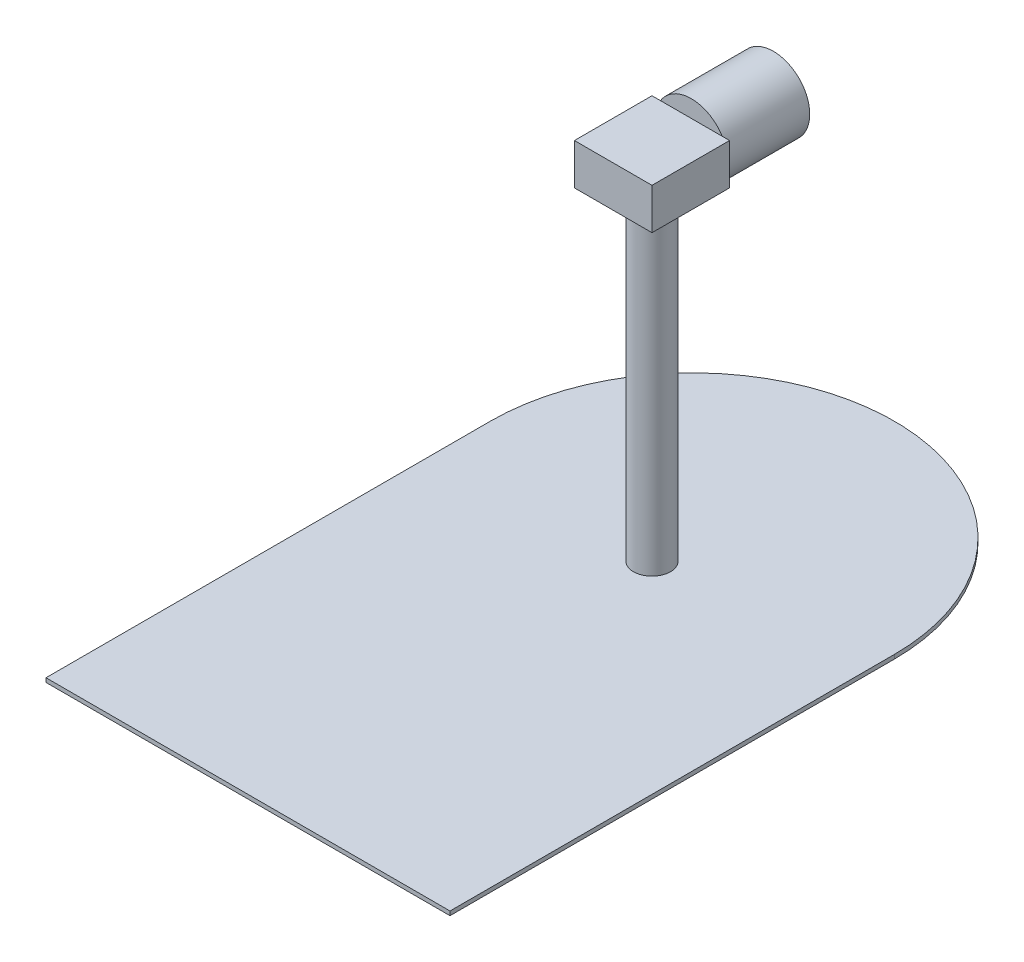
ISO-10303-21;
HEADER;
FILE_DESCRIPTION(('STEP AP214'),'2;1');
FILE_NAME('part.step','',(''),(''),'','','');
FILE_SCHEMA(('AUTOMOTIVE_DESIGN { 1 0 10303 214 1 1 1 1 }'));
ENDSEC;
DATA;
#1=APPLICATION_CONTEXT('core data for automotive mechanical design processes');
#2=APPLICATION_PROTOCOL_DEFINITION('international standard','automotive_design',2000,#1);
#3=PRODUCT_CONTEXT('',#1,'mechanical');
#4=PRODUCT('Part','Part','',(#3));
#5=PRODUCT_RELATED_PRODUCT_CATEGORY('part','',(#4));
#6=PRODUCT_DEFINITION_FORMATION('','',#4);
#7=PRODUCT_DEFINITION_CONTEXT('part definition',#1,'design');
#8=PRODUCT_DEFINITION('design','',#6,#7);
#9=PRODUCT_DEFINITION_SHAPE('','',#8);
#10=(LENGTH_UNIT() NAMED_UNIT(*) SI_UNIT(.MILLI.,.METRE.));
#11=(NAMED_UNIT(*) PLANE_ANGLE_UNIT() SI_UNIT($,.RADIAN.));
#12=(NAMED_UNIT(*) SI_UNIT($,.STERADIAN.) SOLID_ANGLE_UNIT());
#13=UNCERTAINTY_MEASURE_WITH_UNIT(LENGTH_MEASURE(1.E-05),#10,'distance_accuracy_value','');
#14=(GEOMETRIC_REPRESENTATION_CONTEXT(3) GLOBAL_UNCERTAINTY_ASSIGNED_CONTEXT((#13)) GLOBAL_UNIT_ASSIGNED_CONTEXT((#10,
#11,#12)) REPRESENTATION_CONTEXT('',''));
#15=CARTESIAN_POINT('',(0.,0.,0.));
#16=DIRECTION('',(0.,0.,1.));
#17=DIRECTION('',(1.,0.,0.));
#18=AXIS2_PLACEMENT_3D('',#15,#16,#17);
#19=CARTESIAN_POINT('',(0.,227.94,-123.520176163364));
#20=DIRECTION('',(0.,0.,1.));
#21=DIRECTION('',(1.,0.,0.));
#22=AXIS2_PLACEMENT_3D('',#19,#20,#21);
#23=PLANE('',#22);
#24=CARTESIAN_POINT('',(8.00079554888725,216.051385612118,-123.520176163364));
#25=DIRECTION('',(0.,0.,-1.));
#26=DIRECTION('',(-1.,0.,0.));
#27=AXIS2_PLACEMENT_3D('',#24,#25,#26);
#28=CIRCLE('',#27,22.499999958);
#29=CARTESIAN_POINT('',(27.1034353153236,227.94,-123.520176163364));
#30=VERTEX_POINT('',#29);
#31=CARTESIAN_POINT('',(25.9922506582068,202.54,-123.520176163364));
#32=VERTEX_POINT('',#31);
#33=EDGE_CURVE('E11',#30,#32,#28,.T.);
#34=ORIENTED_EDGE('',*,*,#33,.F.);
#35=DIRECTION('',(-1.,0.,0.));
#36=VECTOR('',#35,1.);
#37=CARTESIAN_POINT('',(0.,227.94,-123.520176163364));
#38=LINE('',#37,#36);
#39=CARTESIAN_POINT('',(31.6712566421696,227.94,-123.520176163364));
#40=VERTEX_POINT('',#39);
#41=EDGE_CURVE('E121',#40,#30,#38,.T.);
#42=ORIENTED_EDGE('',*,*,#41,.F.);
#43=DIRECTION('',(0.,-1.,0.));
#44=VECTOR('',#43,1.);
#45=CARTESIAN_POINT('',(31.6712566421696,227.94,-123.520176163364));
#46=LINE('',#45,#44);
#47=CARTESIAN_POINT('',(31.6712566421696,202.54,-123.520176163364));
#48=VERTEX_POINT('',#47);
#49=EDGE_CURVE('E160',#40,#48,#46,.T.);
#50=ORIENTED_EDGE('',*,*,#49,.T.);
#51=DIRECTION('',(-1.,0.,0.));
#52=VECTOR('',#51,1.);
#53=CARTESIAN_POINT('',(0.,202.54,-123.520176163364));
#54=LINE('',#53,#52);
#55=EDGE_CURVE('E145',#48,#32,#54,.T.);
#56=ORIENTED_EDGE('',*,*,#55,.T.);
#57=EDGE_LOOP('',(#34,#42,#50,#56));
#58=FACE_BOUND('',#57,.T.);
#59=ADVANCED_FACE('F37',(#58),#23,.F.);
#60=CARTESIAN_POINT('',(-9.99065956043231,202.54,-123.520176163364));
#61=VERTEX_POINT('',#60);
#62=CARTESIAN_POINT('',(-11.1018442175491,227.94,-123.520176163364));
#63=VERTEX_POINT('',#62);
#64=EDGE_CURVE('E46',#61,#63,#28,.T.);
#65=ORIENTED_EDGE('',*,*,#64,.F.);
#66=CARTESIAN_POINT('',(-16.3287433698304,202.54,-123.520176163364));
#67=VERTEX_POINT('',#66);
#68=EDGE_CURVE('E156',#61,#67,#54,.T.);
#69=ORIENTED_EDGE('',*,*,#68,.T.);
#70=DIRECTION('',(0.,-1.,0.));
#71=VECTOR('',#70,1.);
#72=CARTESIAN_POINT('',(-16.3287433698304,227.94,-123.520176163364));
#73=LINE('',#72,#71);
#74=CARTESIAN_POINT('',(-16.3287433698304,227.94,-123.520176163364));
#75=VERTEX_POINT('',#74);
#76=EDGE_CURVE('E128',#75,#67,#73,.T.);
#77=ORIENTED_EDGE('',*,*,#76,.F.);
#78=EDGE_CURVE('E119',#63,#75,#38,.T.);
#79=ORIENTED_EDGE('',*,*,#78,.F.);
#80=EDGE_LOOP('',(#65,#69,#77,#79));
#81=FACE_BOUND('',#80,.T.);
#82=ADVANCED_FACE('F126',(#81),#23,.F.);
#83=CARTESIAN_POINT('',(7.67125663616963,2.54,-124.520176131364));
#84=DIRECTION('',(0.,1.,0.));
#85=DIRECTION('',(0.,0.,1.));
#86=AXIS2_PLACEMENT_3D('',#83,#84,#85);
#87=PLANE('',#86);
#88=DIRECTION('',(0.,0.,-1.));
#89=VECTOR('',#88,1.);
#90=CARTESIAN_POINT('',(132.67125663617,2.54,150.479823868636));
#91=LINE('',#90,#89);
#92=CARTESIAN_POINT('',(132.67125663617,2.54,150.479823868636));
#93=VERTEX_POINT('',#92);
#94=CARTESIAN_POINT('',(132.67125663617,2.54,-124.520176131364));
#95=VERTEX_POINT('',#94);
#96=EDGE_CURVE('E174',#93,#95,#91,.T.);
#97=ORIENTED_EDGE('',*,*,#96,.T.);
#98=CARTESIAN_POINT('',(7.67125663616963,2.54,-124.520176131364));
#99=DIRECTION('',(0.,1.,0.));
#100=DIRECTION('',(0.,0.,1.));
#101=AXIS2_PLACEMENT_3D('',#98,#99,#100);
#102=CIRCLE('',#101,125.);
#103=CARTESIAN_POINT('',(-117.32874336383,2.54,-124.520176131364));
#104=VERTEX_POINT('',#103);
#105=EDGE_CURVE('E177',#95,#104,#102,.T.);
#106=ORIENTED_EDGE('',*,*,#105,.T.);
#107=DIRECTION('',(0.,0.,1.));
#108=VECTOR('',#107,1.);
#109=CARTESIAN_POINT('',(-117.32874336383,2.54,150.479823868636));
#110=LINE('',#109,#108);
#111=CARTESIAN_POINT('',(-117.32874336383,2.54,150.479823868636));
#112=VERTEX_POINT('',#111);
#113=EDGE_CURVE('E180',#104,#112,#110,.T.);
#114=ORIENTED_EDGE('',*,*,#113,.T.);
#115=DIRECTION('',(1.,0.,0.));
#116=VECTOR('',#115,1.);
#117=CARTESIAN_POINT('',(132.67125663617,2.54,150.479823868636));
#118=LINE('',#117,#116);
#119=EDGE_CURVE('E182',#112,#93,#118,.T.);
#120=ORIENTED_EDGE('',*,*,#119,.T.);
#121=EDGE_LOOP('',(#97,#106,#114,#120));
#122=FACE_BOUND('',#121,.T.);
#123=CARTESIAN_POINT('',(7.67125663616962,2.54,-99.5201761573642));
#124=DIRECTION('',(0.,1.,0.));
#125=DIRECTION('',(0.,0.,1.));
#126=AXIS2_PLACEMENT_3D('',#123,#124,#125);
#127=CIRCLE('',#126,11.4394753674617);
#128=CARTESIAN_POINT('',(7.67125663616962,2.54,-88.0807007899025));
#129=VERTEX_POINT('',#128);
#130=EDGE_CURVE('E167',#129,#129,#127,.T.);
#131=ORIENTED_EDGE('',*,*,#130,.F.);
#132=EDGE_LOOP('',(#131));
#133=FACE_BOUND('',#132,.T.);
#134=ADVANCED_FACE('F219',(#122,#133),#87,.T.);
#135=CARTESIAN_POINT('',(132.67125663617,2.54,150.479823868636));
#136=DIRECTION('',(-1.,0.,0.));
#137=DIRECTION('',(0.,0.,1.));
#138=AXIS2_PLACEMENT_3D('',#135,#136,#137);
#139=PLANE('',#138);
#140=DIRECTION('',(0.,0.,-1.));
#141=VECTOR('',#140,1.);
#142=CARTESIAN_POINT('',(132.67125663617,0.,150.479823868636));
#143=LINE('',#142,#141);
#144=CARTESIAN_POINT('',(132.67125663617,0.,150.479823868636));
#145=VERTEX_POINT('',#144);
#146=CARTESIAN_POINT('',(132.67125663617,0.,-124.520176131364));
#147=VERTEX_POINT('',#146);
#148=EDGE_CURVE('E171',#145,#147,#143,.T.);
#149=ORIENTED_EDGE('',*,*,#148,.T.);
#150=DIRECTION('',(0.,-1.,0.));
#151=VECTOR('',#150,1.);
#152=CARTESIAN_POINT('',(132.67125663617,2.54,-124.520176131364));
#153=LINE('',#152,#151);
#154=EDGE_CURVE('E41',#95,#147,#153,.T.);
#155=ORIENTED_EDGE('',*,*,#154,.F.);
#156=ORIENTED_EDGE('',*,*,#96,.F.);
#157=DIRECTION('',(0.,-1.,0.));
#158=VECTOR('',#157,1.);
#159=CARTESIAN_POINT('',(132.67125663617,2.54,150.479823868636));
#160=LINE('',#159,#158);
#161=EDGE_CURVE('E184',#93,#145,#160,.T.);
#162=ORIENTED_EDGE('',*,*,#161,.T.);
#163=EDGE_LOOP('',(#149,#155,#156,#162));
#164=FACE_BOUND('',#163,.T.);
#165=ADVANCED_FACE('F39',(#164),#139,.F.);
#166=CARTESIAN_POINT('',(7.67125663616963,2.54,-124.520176131364));
#167=DIRECTION('',(0.,-1.,0.));
#168=DIRECTION('',(0.,0.,-1.));
#169=AXIS2_PLACEMENT_3D('',#166,#167,#168);
#170=CYLINDRICAL_SURFACE('',#169,125.);
#171=CARTESIAN_POINT('',(7.67125663616963,0.,-124.520176131364));
#172=DIRECTION('',(0.,1.,0.));
#173=DIRECTION('',(0.,0.,1.));
#174=AXIS2_PLACEMENT_3D('',#171,#172,#173);
#175=CIRCLE('',#174,125.);
#176=CARTESIAN_POINT('',(-117.32874336383,0.,-124.520176131364));
#177=VERTEX_POINT('',#176);
#178=EDGE_CURVE('E187',#147,#177,#175,.T.);
#179=ORIENTED_EDGE('',*,*,#178,.T.);
#180=DIRECTION('',(0.,-1.,0.));
#181=VECTOR('',#180,1.);
#182=CARTESIAN_POINT('',(-117.32874336383,2.54,-124.520176131364));
#183=LINE('',#182,#181);
#184=EDGE_CURVE('E196',#104,#177,#183,.T.);
#185=ORIENTED_EDGE('',*,*,#184,.F.);
#186=ORIENTED_EDGE('',*,*,#105,.F.);
#187=ORIENTED_EDGE('',*,*,#154,.T.);
#188=EDGE_LOOP('',(#179,#185,#186,#187));
#189=FACE_BOUND('',#188,.T.);
#190=ADVANCED_FACE('F205',(#189),#170,.T.);
#191=CARTESIAN_POINT('',(-117.32874336383,2.54,150.479823868636));
#192=DIRECTION('',(1.,0.,0.));
#193=DIRECTION('',(0.,0.,-1.));
#194=AXIS2_PLACEMENT_3D('',#191,#192,#193);
#195=PLANE('',#194);
#196=DIRECTION('',(0.,0.,1.));
#197=VECTOR('',#196,1.);
#198=CARTESIAN_POINT('',(-117.32874336383,0.,150.479823868636));
#199=LINE('',#198,#197);
#200=CARTESIAN_POINT('',(-117.32874336383,0.,150.479823868636));
#201=VERTEX_POINT('',#200);
#202=EDGE_CURVE('E189',#177,#201,#199,.T.);
#203=ORIENTED_EDGE('',*,*,#202,.T.);
#204=DIRECTION('',(0.,-1.,0.));
#205=VECTOR('',#204,1.);
#206=CARTESIAN_POINT('',(-117.32874336383,2.54,150.479823868636));
#207=LINE('',#206,#205);
#208=EDGE_CURVE('E194',#112,#201,#207,.T.);
#209=ORIENTED_EDGE('',*,*,#208,.F.);
#210=ORIENTED_EDGE('',*,*,#113,.F.);
#211=ORIENTED_EDGE('',*,*,#184,.T.);
#212=EDGE_LOOP('',(#203,#209,#210,#211));
#213=FACE_BOUND('',#212,.T.);
#214=ADVANCED_FACE('F214',(#213),#195,.F.);
#215=CARTESIAN_POINT('',(132.67125663617,2.54,150.479823868636));
#216=DIRECTION('',(0.,0.,-1.));
#217=DIRECTION('',(-1.,0.,0.));
#218=AXIS2_PLACEMENT_3D('',#215,#216,#217);
#219=PLANE('',#218);
#220=DIRECTION('',(1.,0.,0.));
#221=VECTOR('',#220,1.);
#222=CARTESIAN_POINT('',(132.67125663617,0.,150.479823868636));
#223=LINE('',#222,#221);
#224=EDGE_CURVE('E178',#201,#145,#223,.T.);
#225=ORIENTED_EDGE('',*,*,#224,.T.);
#226=ORIENTED_EDGE('',*,*,#161,.F.);
#227=ORIENTED_EDGE('',*,*,#119,.F.);
#228=ORIENTED_EDGE('',*,*,#208,.T.);
#229=EDGE_LOOP('',(#225,#226,#227,#228));
#230=FACE_BOUND('',#229,.T.);
#231=ADVANCED_FACE('F217',(#230),#219,.F.);
#232=CARTESIAN_POINT('',(7.67125663616963,0.,-124.520176131364));
#233=DIRECTION('',(0.,1.,0.));
#234=DIRECTION('',(0.,0.,1.));
#235=AXIS2_PLACEMENT_3D('',#232,#233,#234);
#236=PLANE('',#235);
#237=ORIENTED_EDGE('',*,*,#148,.F.);
#238=ORIENTED_EDGE('',*,*,#224,.F.);
#239=ORIENTED_EDGE('',*,*,#202,.F.);
#240=ORIENTED_EDGE('',*,*,#178,.F.);
#241=EDGE_LOOP('',(#237,#238,#239,#240));
#242=FACE_BOUND('',#241,.T.);
#243=ADVANCED_FACE('F212',(#242),#236,.F.);
#244=CARTESIAN_POINT('',(7.67125663616962,202.54,-99.5201761573642));
#245=DIRECTION('',(0.,-1.,0.));
#246=DIRECTION('',(0.,0.,-1.));
#247=AXIS2_PLACEMENT_3D('',#244,#245,#246);
#248=CYLINDRICAL_SURFACE('',#247,11.4394753674617);
#249=CARTESIAN_POINT('',(7.67125663616962,202.54,-99.5201761573642));
#250=DIRECTION('',(0.,1.,0.));
#251=DIRECTION('',(0.,0.,1.));
#252=AXIS2_PLACEMENT_3D('',#249,#250,#251);
#253=CIRCLE('',#252,11.4394753674617);
#254=CARTESIAN_POINT('',(7.67125663616962,202.54,-88.0807007899025));
#255=VERTEX_POINT('',#254);
#256=EDGE_CURVE('E168',#255,#255,#253,.T.);
#257=ORIENTED_EDGE('',*,*,#256,.F.);
#258=EDGE_LOOP('',(#257));
#259=FACE_BOUND('',#258,.T.);
#260=ORIENTED_EDGE('',*,*,#130,.T.);
#261=EDGE_LOOP('',(#260));
#262=FACE_BOUND('',#261,.T.);
#263=ADVANCED_FACE('F225',(#259,#262),#248,.T.);
#264=CARTESIAN_POINT('',(0.,202.54,0.));
#265=DIRECTION('',(0.,1.,0.));
#266=DIRECTION('',(0.,0.,1.));
#267=AXIS2_PLACEMENT_3D('',#264,#265,#266);
#268=PLANE('',#267);
#269=DIRECTION('',(0.,0.,-1.));
#270=VECTOR('',#269,1.);
#271=CARTESIAN_POINT('',(-16.3287433698304,202.54,0.));
#272=LINE('',#271,#270);
#273=CARTESIAN_POINT('',(-16.3287433698304,202.54,-75.5201761513642));
#274=VERTEX_POINT('',#273);
#275=EDGE_CURVE('E139',#274,#67,#272,.T.);
#276=ORIENTED_EDGE('',*,*,#275,.T.);
#277=ORIENTED_EDGE('',*,*,#68,.F.);
#278=EDGE_CURVE('E158',#32,#61,#54,.T.);
#279=ORIENTED_EDGE('',*,*,#278,.F.);
#280=ORIENTED_EDGE('',*,*,#55,.F.);
#281=DIRECTION('',(0.,0.,-1.));
#282=VECTOR('',#281,1.);
#283=CARTESIAN_POINT('',(31.6712566421696,202.54,0.));
#284=LINE('',#283,#282);
#285=CARTESIAN_POINT('',(31.6712566421696,202.54,-75.5201761513642));
#286=VERTEX_POINT('',#285);
#287=EDGE_CURVE('E154',#286,#48,#284,.T.);
#288=ORIENTED_EDGE('',*,*,#287,.F.);
#289=DIRECTION('',(-1.,0.,0.));
#290=VECTOR('',#289,1.);
#291=CARTESIAN_POINT('',(0.,202.54,-75.5201761513642));
#292=LINE('',#291,#290);
#293=EDGE_CURVE('E151',#286,#274,#292,.T.);
#294=ORIENTED_EDGE('',*,*,#293,.T.);
#295=EDGE_LOOP('',(#276,#277,#279,#280,#288,#294));
#296=FACE_BOUND('',#295,.T.);
#297=ORIENTED_EDGE('',*,*,#256,.T.);
#298=EDGE_LOOP('',(#297));
#299=FACE_BOUND('',#298,.T.);
#300=ADVANCED_FACE('F227',(#296,#299),#268,.F.);
#301=CARTESIAN_POINT('',(-16.3287433698304,227.94,0.));
#302=DIRECTION('',(-1.,0.,0.));
#303=DIRECTION('',(0.,0.,1.));
#304=AXIS2_PLACEMENT_3D('',#301,#302,#303);
#305=PLANE('',#304);
#306=ORIENTED_EDGE('',*,*,#275,.F.);
#307=DIRECTION('',(0.,-1.,0.));
#308=VECTOR('',#307,1.);
#309=CARTESIAN_POINT('',(-16.3287433698304,227.94,-75.5201761513642));
#310=LINE('',#309,#308);
#311=CARTESIAN_POINT('',(-16.3287433698304,227.94,-75.5201761513642));
#312=VERTEX_POINT('',#311);
#313=EDGE_CURVE('E165',#312,#274,#310,.T.);
#314=ORIENTED_EDGE('',*,*,#313,.F.);
#315=DIRECTION('',(0.,0.,-1.));
#316=VECTOR('',#315,1.);
#317=CARTESIAN_POINT('',(-16.3287433698304,227.94,0.));
#318=LINE('',#317,#316);
#319=EDGE_CURVE('E142',#312,#75,#318,.T.);
#320=ORIENTED_EDGE('',*,*,#319,.T.);
#321=ORIENTED_EDGE('',*,*,#76,.T.);
#322=EDGE_LOOP('',(#306,#314,#320,#321));
#323=FACE_BOUND('',#322,.T.);
#324=ADVANCED_FACE('F234',(#323),#305,.T.);
#325=CARTESIAN_POINT('',(0.,227.94,-75.5201761513642));
#326=DIRECTION('',(0.,0.,1.));
#327=DIRECTION('',(1.,0.,0.));
#328=AXIS2_PLACEMENT_3D('',#325,#326,#327);
#329=PLANE('',#328);
#330=ORIENTED_EDGE('',*,*,#293,.F.);
#331=DIRECTION('',(0.,-1.,0.));
#332=VECTOR('',#331,1.);
#333=CARTESIAN_POINT('',(31.6712566421696,227.94,-75.5201761513642));
#334=LINE('',#333,#332);
#335=CARTESIAN_POINT('',(31.6712566421696,227.94,-75.5201761513642));
#336=VERTEX_POINT('',#335);
#337=EDGE_CURVE('E163',#336,#286,#334,.T.);
#338=ORIENTED_EDGE('',*,*,#337,.F.);
#339=DIRECTION('',(-1.,0.,0.));
#340=VECTOR('',#339,1.);
#341=CARTESIAN_POINT('',(0.,227.94,-75.5201761513642));
#342=LINE('',#341,#340);
#343=EDGE_CURVE('E144',#336,#312,#342,.T.);
#344=ORIENTED_EDGE('',*,*,#343,.T.);
#345=ORIENTED_EDGE('',*,*,#313,.T.);
#346=EDGE_LOOP('',(#330,#338,#344,#345));
#347=FACE_BOUND('',#346,.T.);
#348=ADVANCED_FACE('F251',(#347),#329,.T.);
#349=CARTESIAN_POINT('',(31.6712566421696,227.94,0.));
#350=DIRECTION('',(-1.,0.,0.));
#351=DIRECTION('',(0.,0.,1.));
#352=AXIS2_PLACEMENT_3D('',#349,#350,#351);
#353=PLANE('',#352);
#354=ORIENTED_EDGE('',*,*,#287,.T.);
#355=ORIENTED_EDGE('',*,*,#49,.F.);
#356=DIRECTION('',(0.,0.,-1.));
#357=VECTOR('',#356,1.);
#358=CARTESIAN_POINT('',(31.6712566421696,227.94,0.));
#359=LINE('',#358,#357);
#360=EDGE_CURVE('E130',#336,#40,#359,.T.);
#361=ORIENTED_EDGE('',*,*,#360,.F.);
#362=ORIENTED_EDGE('',*,*,#337,.T.);
#363=EDGE_LOOP('',(#354,#355,#361,#362));
#364=FACE_BOUND('',#363,.T.);
#365=ADVANCED_FACE('F248',(#364),#353,.F.);
#366=CARTESIAN_POINT('',(0.,227.94,0.));
#367=DIRECTION('',(0.,1.,0.));
#368=DIRECTION('',(0.,0.,1.));
#369=AXIS2_PLACEMENT_3D('',#366,#367,#368);
#370=PLANE('',#369);
#371=ORIENTED_EDGE('',*,*,#319,.F.);
#372=ORIENTED_EDGE('',*,*,#343,.F.);
#373=ORIENTED_EDGE('',*,*,#360,.T.);
#374=ORIENTED_EDGE('',*,*,#41,.T.);
#375=EDGE_CURVE('E116',#30,#63,#38,.T.);
#376=ORIENTED_EDGE('',*,*,#375,.T.);
#377=ORIENTED_EDGE('',*,*,#78,.T.);
#378=EDGE_LOOP('',(#371,#372,#373,#374,#376,#377));
#379=FACE_BOUND('',#378,.T.);
#380=ADVANCED_FACE('F118',(#379),#370,.T.);
#381=CARTESIAN_POINT('',(8.00079554888725,216.051385612118,-123.520176163364));
#382=DIRECTION('',(0.,0.,-1.));
#383=DIRECTION('',(-1.,0.,0.));
#384=AXIS2_PLACEMENT_3D('',#381,#382,#383);
#385=PLANE('',#384);
#386=EDGE_CURVE('E48',#32,#61,#28,.T.);
#387=ORIENTED_EDGE('',*,*,#386,.F.);
#388=ORIENTED_EDGE('',*,*,#278,.T.);
#389=EDGE_LOOP('',(#387,#388));
#390=FACE_BOUND('',#389,.T.);
#391=ADVANCED_FACE('F269',(#390),#385,.F.);
#392=CARTESIAN_POINT('',(8.00079554888725,216.051385612118,-174.320176163364));
#393=DIRECTION('',(0.,0.,1.));
#394=DIRECTION('',(1.,0.,0.));
#395=AXIS2_PLACEMENT_3D('',#392,#393,#394);
#396=CYLINDRICAL_SURFACE('',#395,22.499999958);
#397=CARTESIAN_POINT('',(8.00079554888725,216.051385612118,-174.320176163364));
#398=DIRECTION('',(0.,0.,-1.));
#399=DIRECTION('',(-1.,0.,0.));
#400=AXIS2_PLACEMENT_3D('',#397,#398,#399);
#401=CIRCLE('',#400,22.499999958);
#402=CARTESIAN_POINT('',(-14.4992044091128,216.051385612118,-174.320176163364));
#403=VERTEX_POINT('',#402);
#404=EDGE_CURVE('E137',#403,#403,#401,.T.);
#405=ORIENTED_EDGE('',*,*,#404,.F.);
#406=EDGE_LOOP('',(#405));
#407=FACE_BOUND('',#406,.T.);
#408=EDGE_CURVE('E134',#63,#30,#28,.T.);
#409=ORIENTED_EDGE('',*,*,#408,.T.);
#410=ORIENTED_EDGE('',*,*,#33,.T.);
#411=ORIENTED_EDGE('',*,*,#386,.T.);
#412=ORIENTED_EDGE('',*,*,#64,.T.);
#413=EDGE_LOOP('',(#409,#410,#411,#412));
#414=FACE_BOUND('',#413,.T.);
#415=ADVANCED_FACE('F133',(#407,#414),#396,.T.);
#416=CARTESIAN_POINT('',(8.00079554888725,216.051385612118,-174.320176163364));
#417=DIRECTION('',(0.,0.,-1.));
#418=DIRECTION('',(-1.,0.,0.));
#419=AXIS2_PLACEMENT_3D('',#416,#417,#418);
#420=PLANE('',#419);
#421=ORIENTED_EDGE('',*,*,#404,.T.);
#422=EDGE_LOOP('',(#421));
#423=FACE_BOUND('',#422,.T.);
#424=ADVANCED_FACE('F276',(#423),#420,.T.);
#425=ORIENTED_EDGE('',*,*,#375,.F.);
#426=ORIENTED_EDGE('',*,*,#408,.F.);
#427=EDGE_LOOP('',(#425,#426));
#428=FACE_BOUND('',#427,.T.);
#429=ADVANCED_FACE('F136',(#428),#385,.F.);
#430=CLOSED_SHELL('',(#59,#82,#134,#165,#190,#214,#231,#243,#263,#300,#324,#348,#365,#380,#391,
#415,#424,#429));
#431=MANIFOLD_SOLID_BREP('B2',#430);
#432=ADVANCED_BREP_SHAPE_REPRESENTATION('',(#18,#431),#14);
#433=SHAPE_DEFINITION_REPRESENTATION(#9,#432);
ENDSEC;
END-ISO-10303-21;
